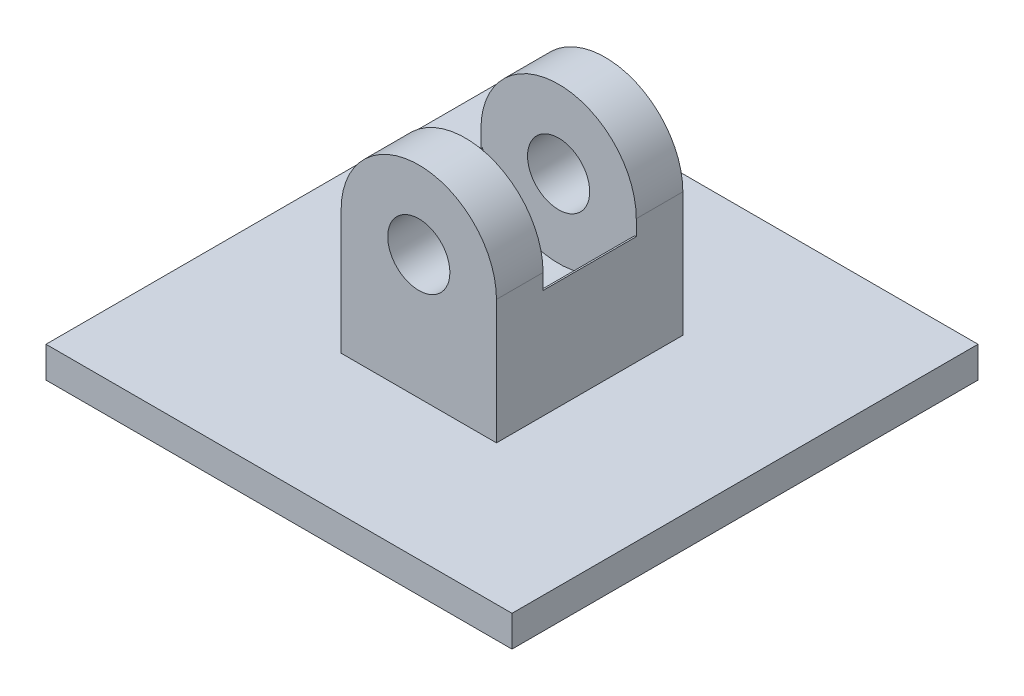
ISO-10303-21;
HEADER;
FILE_DESCRIPTION(('STEP AP214'),'2;1');
FILE_NAME('part.step','',(''),(''),'','','');
FILE_SCHEMA(('AUTOMOTIVE_DESIGN { 1 0 10303 214 1 1 1 1 }'));
ENDSEC;
DATA;
#1=APPLICATION_CONTEXT('core data for automotive mechanical design processes');
#2=APPLICATION_PROTOCOL_DEFINITION('international standard','automotive_design',2000,#1);
#3=PRODUCT_CONTEXT('',#1,'mechanical');
#4=PRODUCT('Part','Part','',(#3));
#5=PRODUCT_RELATED_PRODUCT_CATEGORY('part','',(#4));
#6=PRODUCT_DEFINITION_FORMATION('','',#4);
#7=PRODUCT_DEFINITION_CONTEXT('part definition',#1,'design');
#8=PRODUCT_DEFINITION('design','',#6,#7);
#9=PRODUCT_DEFINITION_SHAPE('','',#8);
#10=(LENGTH_UNIT() NAMED_UNIT(*) SI_UNIT(.MILLI.,.METRE.));
#11=(NAMED_UNIT(*) PLANE_ANGLE_UNIT() SI_UNIT($,.RADIAN.));
#12=(NAMED_UNIT(*) SI_UNIT($,.STERADIAN.) SOLID_ANGLE_UNIT());
#13=UNCERTAINTY_MEASURE_WITH_UNIT(LENGTH_MEASURE(1.E-05),#10,'distance_accuracy_value','');
#14=(GEOMETRIC_REPRESENTATION_CONTEXT(3) GLOBAL_UNCERTAINTY_ASSIGNED_CONTEXT((#13)) GLOBAL_UNIT_ASSIGNED_CONTEXT((#10,
#11,#12)) REPRESENTATION_CONTEXT('',''));
#15=CARTESIAN_POINT('',(0.,0.,0.));
#16=DIRECTION('',(0.,0.,1.));
#17=DIRECTION('',(1.,0.,0.));
#18=AXIS2_PLACEMENT_3D('',#15,#16,#17);
#19=CARTESIAN_POINT('',(0.,50.,-58.2842712474619));
#20=DIRECTION('',(0.,0.,1.));
#21=DIRECTION('',(1.,0.,0.));
#22=AXIS2_PLACEMENT_3D('',#19,#20,#21);
#23=CYLINDRICAL_SURFACE('',#22,10.);
#24=CARTESIAN_POINT('',(0.,50.,-30.));
#25=DIRECTION('',(0.,0.,1.));
#26=DIRECTION('',(1.,0.,0.));
#27=AXIS2_PLACEMENT_3D('',#24,#25,#26);
#28=CIRCLE('',#27,10.);
#29=CARTESIAN_POINT('',(10.,50.,-30.));
#30=VERTEX_POINT('',#29);
#31=EDGE_CURVE('E186',#30,#30,#28,.F.);
#32=ORIENTED_EDGE('',*,*,#31,.T.);
#33=EDGE_LOOP('',(#32));
#34=FACE_BOUND('',#33,.T.);
#35=CARTESIAN_POINT('',(0.,50.,-15.));
#36=DIRECTION('',(0.,0.,-1.));
#37=DIRECTION('',(-1.,0.,0.));
#38=AXIS2_PLACEMENT_3D('',#35,#36,#37);
#39=CIRCLE('',#38,10.);
#40=CARTESIAN_POINT('',(-10.,50.,-15.));
#41=VERTEX_POINT('',#40);
#42=EDGE_CURVE('E56',#41,#41,#39,.F.);
#43=ORIENTED_EDGE('',*,*,#42,.T.);
#44=EDGE_LOOP('',(#43));
#45=FACE_BOUND('',#44,.T.);
#46=ADVANCED_FACE('F48',(#34,#45),#23,.F.);
#47=CARTESIAN_POINT('',(67.4264068711929,45.,15.));
#48=DIRECTION('',(0.,-1.,0.));
#49=DIRECTION('',(0.,0.,-1.));
#50=AXIS2_PLACEMENT_3D('',#47,#48,#49);
#51=PLANE('',#50);
#52=DIRECTION('',(0.,0.,-1.));
#53=VECTOR('',#52,1.);
#54=CARTESIAN_POINT('',(24.4948974278318,45.,85.7106781186548));
#55=LINE('',#54,#53);
#56=CARTESIAN_POINT('',(24.4948974278318,45.,15.));
#57=VERTEX_POINT('',#56);
#58=CARTESIAN_POINT('',(24.4948974278318,45.,-15.));
#59=VERTEX_POINT('',#58);
#60=EDGE_CURVE('E148',#57,#59,#55,.T.);
#61=ORIENTED_EDGE('',*,*,#60,.F.);
#62=DIRECTION('',(-1.,0.,0.));
#63=VECTOR('',#62,1.);
#64=CARTESIAN_POINT('',(67.4264068711929,45.,15.));
#65=LINE('',#64,#63);
#66=CARTESIAN_POINT('',(25.,45.,15.));
#67=VERTEX_POINT('',#66);
#68=EDGE_CURVE('E158',#67,#57,#65,.T.);
#69=ORIENTED_EDGE('',*,*,#68,.F.);
#70=DIRECTION('',(0.,0.,-1.));
#71=VECTOR('',#70,1.);
#72=CARTESIAN_POINT('',(25.,45.,15.));
#73=LINE('',#72,#71);
#74=CARTESIAN_POINT('',(25.,45.,-15.));
#75=VERTEX_POINT('',#74);
#76=EDGE_CURVE('E177',#67,#75,#73,.T.);
#77=ORIENTED_EDGE('',*,*,#76,.T.);
#78=DIRECTION('',(-1.,0.,0.));
#79=VECTOR('',#78,1.);
#80=CARTESIAN_POINT('',(67.4264068711929,45.,-15.));
#81=LINE('',#80,#79);
#82=EDGE_CURVE('E161',#75,#59,#81,.T.);
#83=ORIENTED_EDGE('',*,*,#82,.T.);
#84=EDGE_LOOP('',(#61,#69,#77,#83));
#85=FACE_BOUND('',#84,.T.);
#86=ADVANCED_FACE('F157',(#85),#51,.F.);
#87=DIRECTION('',(0.,0.,-1.));
#88=VECTOR('',#87,1.);
#89=CARTESIAN_POINT('',(-24.4948974278318,45.,85.7106781186548));
#90=LINE('',#89,#88);
#91=CARTESIAN_POINT('',(-24.4948974278318,45.,-15.));
#92=VERTEX_POINT('',#91);
#93=CARTESIAN_POINT('',(-24.4948974278318,45.,15.));
#94=VERTEX_POINT('',#93);
#95=EDGE_CURVE('E13',#92,#94,#90,.F.);
#96=ORIENTED_EDGE('',*,*,#95,.F.);
#97=CARTESIAN_POINT('',(-25.,45.,-15.));
#98=VERTEX_POINT('',#97);
#99=EDGE_CURVE('E176',#92,#98,#81,.T.);
#100=ORIENTED_EDGE('',*,*,#99,.T.);
#101=DIRECTION('',(0.,0.,1.));
#102=VECTOR('',#101,1.);
#103=CARTESIAN_POINT('',(-25.,45.,15.));
#104=LINE('',#103,#102);
#105=CARTESIAN_POINT('',(-25.,45.,15.));
#106=VERTEX_POINT('',#105);
#107=EDGE_CURVE('E278',#98,#106,#104,.T.);
#108=ORIENTED_EDGE('',*,*,#107,.T.);
#109=EDGE_CURVE('E167',#94,#106,#65,.T.);
#110=ORIENTED_EDGE('',*,*,#109,.F.);
#111=EDGE_LOOP('',(#96,#100,#108,#110));
#112=FACE_BOUND('',#111,.T.);
#113=ADVANCED_FACE('F299',(#112),#51,.F.);
#114=CARTESIAN_POINT('',(0.,50.,-85.9016994374947));
#115=DIRECTION('',(0.,0.,1.));
#116=DIRECTION('',(1.,0.,0.));
#117=AXIS2_PLACEMENT_3D('',#114,#115,#116);
#118=CYLINDRICAL_SURFACE('',#117,25.);
#119=CARTESIAN_POINT('',(0.,50.,-15.));
#120=DIRECTION('',(0.,0.,-1.));
#121=DIRECTION('',(-1.,0.,0.));
#122=AXIS2_PLACEMENT_3D('',#119,#120,#121);
#123=CIRCLE('',#122,25.);
#124=CARTESIAN_POINT('',(25.,50.,-15.));
#125=VERTEX_POINT('',#124);
#126=CARTESIAN_POINT('',(-25.,50.,-15.));
#127=VERTEX_POINT('',#126);
#128=EDGE_CURVE('E181',#125,#127,#123,.F.);
#129=ORIENTED_EDGE('',*,*,#128,.F.);
#130=DIRECTION('',(0.,0.,-1.));
#131=VECTOR('',#130,1.);
#132=CARTESIAN_POINT('',(25.,50.,30.));
#133=LINE('',#132,#131);
#134=CARTESIAN_POINT('',(25.,50.,-30.));
#135=VERTEX_POINT('',#134);
#136=EDGE_CURVE('E198',#125,#135,#133,.T.);
#137=ORIENTED_EDGE('',*,*,#136,.T.);
#138=CARTESIAN_POINT('',(0.,50.,-30.));
#139=DIRECTION('',(0.,0.,1.));
#140=DIRECTION('',(1.,0.,0.));
#141=AXIS2_PLACEMENT_3D('',#138,#139,#140);
#142=CIRCLE('',#141,25.);
#143=CARTESIAN_POINT('',(-25.,50.,-30.));
#144=VERTEX_POINT('',#143);
#145=EDGE_CURVE('E190',#144,#135,#142,.F.);
#146=ORIENTED_EDGE('',*,*,#145,.F.);
#147=DIRECTION('',(0.,0.,1.));
#148=VECTOR('',#147,1.);
#149=CARTESIAN_POINT('',(-25.,50.,30.));
#150=LINE('',#149,#148);
#151=EDGE_CURVE('E195',#144,#127,#150,.T.);
#152=ORIENTED_EDGE('',*,*,#151,.T.);
#153=EDGE_LOOP('',(#129,#137,#146,#152));
#154=FACE_BOUND('',#153,.T.);
#155=ADVANCED_FACE('F281',(#154),#118,.T.);
#156=CARTESIAN_POINT('',(-75.,9.99999999999999,75.));
#157=DIRECTION('',(1.,0.,0.));
#158=DIRECTION('',(0.,0.,-1.));
#159=AXIS2_PLACEMENT_3D('',#156,#157,#158);
#160=PLANE('',#159);
#161=DIRECTION('',(0.,0.,1.));
#162=VECTOR('',#161,1.);
#163=CARTESIAN_POINT('',(-75.,0.,75.));
#164=LINE('',#163,#162);
#165=CARTESIAN_POINT('',(-75.,0.,-75.));
#166=VERTEX_POINT('',#165);
#167=CARTESIAN_POINT('',(-75.,0.,75.));
#168=VERTEX_POINT('',#167);
#169=EDGE_CURVE('E224',#166,#168,#164,.T.);
#170=ORIENTED_EDGE('',*,*,#169,.T.);
#171=DIRECTION('',(0.,-1.,0.));
#172=VECTOR('',#171,1.);
#173=CARTESIAN_POINT('',(-75.,9.99999999999999,75.));
#174=LINE('',#173,#172);
#175=CARTESIAN_POINT('',(-75.,9.99999999999999,75.));
#176=VERTEX_POINT('',#175);
#177=EDGE_CURVE('E251',#176,#168,#174,.T.);
#178=ORIENTED_EDGE('',*,*,#177,.F.);
#179=DIRECTION('',(0.,0.,1.));
#180=VECTOR('',#179,1.);
#181=CARTESIAN_POINT('',(-75.,9.99999999999999,75.));
#182=LINE('',#181,#180);
#183=CARTESIAN_POINT('',(-75.,9.99999999999999,-75.));
#184=VERTEX_POINT('',#183);
#185=EDGE_CURVE('E225',#184,#176,#182,.T.);
#186=ORIENTED_EDGE('',*,*,#185,.F.);
#187=DIRECTION('',(0.,-1.,0.));
#188=VECTOR('',#187,1.);
#189=CARTESIAN_POINT('',(-75.,9.99999999999999,-75.));
#190=LINE('',#189,#188);
#191=EDGE_CURVE('E235',#184,#166,#190,.T.);
#192=ORIENTED_EDGE('',*,*,#191,.T.);
#193=EDGE_LOOP('',(#170,#178,#186,#192));
#194=FACE_BOUND('',#193,.T.);
#195=ADVANCED_FACE('F50',(#194),#160,.F.);
#196=CARTESIAN_POINT('',(75.,9.99999999999999,74.9999999999999));
#197=DIRECTION('',(0.,0.,-1.));
#198=DIRECTION('',(-1.,0.,0.));
#199=AXIS2_PLACEMENT_3D('',#196,#197,#198);
#200=PLANE('',#199);
#201=DIRECTION('',(1.,0.,0.));
#202=VECTOR('',#201,1.);
#203=CARTESIAN_POINT('',(75.,0.,74.9999999999999));
#204=LINE('',#203,#202);
#205=CARTESIAN_POINT('',(75.,0.,74.9999999999999));
#206=VERTEX_POINT('',#205);
#207=EDGE_CURVE('E238',#168,#206,#204,.T.);
#208=ORIENTED_EDGE('',*,*,#207,.T.);
#209=DIRECTION('',(0.,-1.,0.));
#210=VECTOR('',#209,1.);
#211=CARTESIAN_POINT('',(75.,9.99999999999999,74.9999999999999));
#212=LINE('',#211,#210);
#213=CARTESIAN_POINT('',(75.,9.99999999999999,74.9999999999999));
#214=VERTEX_POINT('',#213);
#215=EDGE_CURVE('E248',#214,#206,#212,.T.);
#216=ORIENTED_EDGE('',*,*,#215,.F.);
#217=DIRECTION('',(1.,0.,0.));
#218=VECTOR('',#217,1.);
#219=CARTESIAN_POINT('',(75.,9.99999999999999,74.9999999999999));
#220=LINE('',#219,#218);
#221=EDGE_CURVE('E228',#176,#214,#220,.T.);
#222=ORIENTED_EDGE('',*,*,#221,.F.);
#223=ORIENTED_EDGE('',*,*,#177,.T.);
#224=EDGE_LOOP('',(#208,#216,#222,#223));
#225=FACE_BOUND('',#224,.T.);
#226=ADVANCED_FACE('F345',(#225),#200,.F.);
#227=CARTESIAN_POINT('',(75.,9.99999999999999,74.9999999999999));
#228=DIRECTION('',(-1.,0.,0.));
#229=DIRECTION('',(0.,0.,1.));
#230=AXIS2_PLACEMENT_3D('',#227,#228,#229);
#231=PLANE('',#230);
#232=DIRECTION('',(0.,0.,-1.));
#233=VECTOR('',#232,1.);
#234=CARTESIAN_POINT('',(75.,0.,74.9999999999999));
#235=LINE('',#234,#233);
#236=CARTESIAN_POINT('',(75.,0.,-75.0000000000001));
#237=VERTEX_POINT('',#236);
#238=EDGE_CURVE('E240',#206,#237,#235,.T.);
#239=ORIENTED_EDGE('',*,*,#238,.T.);
#240=DIRECTION('',(0.,-1.,0.));
#241=VECTOR('',#240,1.);
#242=CARTESIAN_POINT('',(75.,9.99999999999999,-75.0000000000001));
#243=LINE('',#242,#241);
#244=CARTESIAN_POINT('',(75.,9.99999999999999,-75.0000000000001));
#245=VERTEX_POINT('',#244);
#246=EDGE_CURVE('E245',#245,#237,#243,.T.);
#247=ORIENTED_EDGE('',*,*,#246,.F.);
#248=DIRECTION('',(0.,0.,-1.));
#249=VECTOR('',#248,1.);
#250=CARTESIAN_POINT('',(75.,9.99999999999999,74.9999999999999));
#251=LINE('',#250,#249);
#252=EDGE_CURVE('E231',#214,#245,#251,.T.);
#253=ORIENTED_EDGE('',*,*,#252,.F.);
#254=ORIENTED_EDGE('',*,*,#215,.T.);
#255=EDGE_LOOP('',(#239,#247,#253,#254));
#256=FACE_BOUND('',#255,.T.);
#257=ADVANCED_FACE('F342',(#256),#231,.F.);
#258=CARTESIAN_POINT('',(75.,9.99999999999999,-75.0000000000001));
#259=DIRECTION('',(0.,0.,1.));
#260=DIRECTION('',(1.,0.,0.));
#261=AXIS2_PLACEMENT_3D('',#258,#259,#260);
#262=PLANE('',#261);
#263=DIRECTION('',(-1.,0.,0.));
#264=VECTOR('',#263,1.);
#265=CARTESIAN_POINT('',(75.,0.,-75.0000000000001));
#266=LINE('',#265,#264);
#267=EDGE_CURVE('E229',#237,#166,#266,.T.);
#268=ORIENTED_EDGE('',*,*,#267,.T.);
#269=ORIENTED_EDGE('',*,*,#191,.F.);
#270=DIRECTION('',(-1.,0.,0.));
#271=VECTOR('',#270,1.);
#272=CARTESIAN_POINT('',(75.,9.99999999999999,-75.0000000000001));
#273=LINE('',#272,#271);
#274=EDGE_CURVE('E233',#245,#184,#273,.T.);
#275=ORIENTED_EDGE('',*,*,#274,.F.);
#276=ORIENTED_EDGE('',*,*,#246,.T.);
#277=EDGE_LOOP('',(#268,#269,#275,#276));
#278=FACE_BOUND('',#277,.T.);
#279=ADVANCED_FACE('F336',(#278),#262,.F.);
#280=CARTESIAN_POINT('',(0.,9.99999999999999,0.));
#281=DIRECTION('',(0.,1.,0.));
#282=DIRECTION('',(0.,0.,1.));
#283=AXIS2_PLACEMENT_3D('',#280,#281,#282);
#284=PLANE('',#283);
#285=DIRECTION('',(0.,0.,1.));
#286=VECTOR('',#285,1.);
#287=CARTESIAN_POINT('',(-25.,9.99999999999999,30.));
#288=LINE('',#287,#286);
#289=CARTESIAN_POINT('',(-25.,9.99999999999999,-30.));
#290=VERTEX_POINT('',#289);
#291=CARTESIAN_POINT('',(-25.,9.99999999999999,30.));
#292=VERTEX_POINT('',#291);
#293=EDGE_CURVE('E70',#290,#292,#288,.T.);
#294=ORIENTED_EDGE('',*,*,#293,.F.);
#295=DIRECTION('',(-1.,0.,0.));
#296=VECTOR('',#295,1.);
#297=CARTESIAN_POINT('',(25.,9.99999999999999,-30.));
#298=LINE('',#297,#296);
#299=CARTESIAN_POINT('',(25.,9.99999999999999,-30.));
#300=VERTEX_POINT('',#299);
#301=EDGE_CURVE('E211',#300,#290,#298,.T.);
#302=ORIENTED_EDGE('',*,*,#301,.F.);
#303=DIRECTION('',(0.,0.,-1.));
#304=VECTOR('',#303,1.);
#305=CARTESIAN_POINT('',(25.,9.99999999999999,30.));
#306=LINE('',#305,#304);
#307=CARTESIAN_POINT('',(25.,9.99999999999999,30.));
#308=VERTEX_POINT('',#307);
#309=EDGE_CURVE('E208',#308,#300,#306,.T.);
#310=ORIENTED_EDGE('',*,*,#309,.F.);
#311=DIRECTION('',(1.,0.,0.));
#312=VECTOR('',#311,1.);
#313=CARTESIAN_POINT('',(25.,9.99999999999999,30.));
#314=LINE('',#313,#312);
#315=EDGE_CURVE('E205',#292,#308,#314,.T.);
#316=ORIENTED_EDGE('',*,*,#315,.F.);
#317=EDGE_LOOP('',(#294,#302,#310,#316));
#318=FACE_BOUND('',#317,.T.);
#319=ORIENTED_EDGE('',*,*,#185,.T.);
#320=ORIENTED_EDGE('',*,*,#221,.T.);
#321=ORIENTED_EDGE('',*,*,#252,.T.);
#322=ORIENTED_EDGE('',*,*,#274,.T.);
#323=EDGE_LOOP('',(#319,#320,#321,#322));
#324=FACE_BOUND('',#323,.T.);
#325=ADVANCED_FACE('F333',(#318,#324),#284,.T.);
#326=CARTESIAN_POINT('',(0.,0.,0.));
#327=DIRECTION('',(0.,1.,0.));
#328=DIRECTION('',(0.,0.,1.));
#329=AXIS2_PLACEMENT_3D('',#326,#327,#328);
#330=PLANE('',#329);
#331=ORIENTED_EDGE('',*,*,#169,.F.);
#332=ORIENTED_EDGE('',*,*,#267,.F.);
#333=ORIENTED_EDGE('',*,*,#238,.F.);
#334=ORIENTED_EDGE('',*,*,#207,.F.);
#335=EDGE_LOOP('',(#331,#332,#333,#334));
#336=FACE_BOUND('',#335,.T.);
#337=ADVANCED_FACE('F329',(#336),#330,.F.);
#338=CARTESIAN_POINT('',(-25.,50.,30.));
#339=DIRECTION('',(1.,0.,0.));
#340=DIRECTION('',(0.,0.,-1.));
#341=AXIS2_PLACEMENT_3D('',#338,#339,#340);
#342=PLANE('',#341);
#343=ORIENTED_EDGE('',*,*,#107,.F.);
#344=DIRECTION('',(0.,-1.,0.));
#345=VECTOR('',#344,1.);
#346=CARTESIAN_POINT('',(-25.,45.,-15.));
#347=LINE('',#346,#345);
#348=EDGE_CURVE('E162',#127,#98,#347,.T.);
#349=ORIENTED_EDGE('',*,*,#348,.F.);
#350=ORIENTED_EDGE('',*,*,#151,.F.);
#351=DIRECTION('',(0.,-1.,0.));
#352=VECTOR('',#351,1.);
#353=CARTESIAN_POINT('',(-25.,50.,-30.));
#354=LINE('',#353,#352);
#355=EDGE_CURVE('E203',#144,#290,#354,.T.);
#356=ORIENTED_EDGE('',*,*,#355,.T.);
#357=ORIENTED_EDGE('',*,*,#293,.T.);
#358=DIRECTION('',(0.,-1.,0.));
#359=VECTOR('',#358,1.);
#360=CARTESIAN_POINT('',(-25.,50.,30.));
#361=LINE('',#360,#359);
#362=CARTESIAN_POINT('',(-25.,50.,30.));
#363=VERTEX_POINT('',#362);
#364=EDGE_CURVE('E221',#363,#292,#361,.T.);
#365=ORIENTED_EDGE('',*,*,#364,.F.);
#366=CARTESIAN_POINT('',(-25.,50.,15.));
#367=VERTEX_POINT('',#366);
#368=EDGE_CURVE('E199',#367,#363,#150,.T.);
#369=ORIENTED_EDGE('',*,*,#368,.F.);
#370=DIRECTION('',(0.,1.,0.));
#371=VECTOR('',#370,1.);
#372=CARTESIAN_POINT('',(-25.,45.,15.));
#373=LINE('',#372,#371);
#374=EDGE_CURVE('E173',#106,#367,#373,.T.);
#375=ORIENTED_EDGE('',*,*,#374,.F.);
#376=EDGE_LOOP('',(#343,#349,#350,#356,#357,#365,#369,#375));
#377=FACE_BOUND('',#376,.T.);
#378=ADVANCED_FACE('F274',(#377),#342,.F.);
#379=CARTESIAN_POINT('',(25.,50.,30.));
#380=DIRECTION('',(0.,0.,-1.));
#381=DIRECTION('',(-1.,0.,0.));
#382=AXIS2_PLACEMENT_3D('',#379,#380,#381);
#383=PLANE('',#382);
#384=CARTESIAN_POINT('',(0.,50.,30.));
#385=DIRECTION('',(0.,0.,1.));
#386=DIRECTION('',(1.,0.,0.));
#387=AXIS2_PLACEMENT_3D('',#384,#385,#386);
#388=CIRCLE('',#387,10.);
#389=CARTESIAN_POINT('',(10.,50.,30.));
#390=VERTEX_POINT('',#389);
#391=EDGE_CURVE('E183',#390,#390,#388,.T.);
#392=ORIENTED_EDGE('',*,*,#391,.F.);
#393=EDGE_LOOP('',(#392));
#394=FACE_BOUND('',#393,.T.);
#395=ORIENTED_EDGE('',*,*,#315,.T.);
#396=DIRECTION('',(0.,-1.,0.));
#397=VECTOR('',#396,1.);
#398=CARTESIAN_POINT('',(25.,50.,30.));
#399=LINE('',#398,#397);
#400=CARTESIAN_POINT('',(25.,50.,30.));
#401=VERTEX_POINT('',#400);
#402=EDGE_CURVE('E218',#401,#308,#399,.T.);
#403=ORIENTED_EDGE('',*,*,#402,.F.);
#404=CARTESIAN_POINT('',(0.,50.,30.));
#405=DIRECTION('',(0.,0.,1.));
#406=DIRECTION('',(1.,0.,0.));
#407=AXIS2_PLACEMENT_3D('',#404,#405,#406);
#408=CIRCLE('',#407,25.);
#409=EDGE_CURVE('E189',#401,#363,#408,.T.);
#410=ORIENTED_EDGE('',*,*,#409,.T.);
#411=ORIENTED_EDGE('',*,*,#364,.T.);
#412=EDGE_LOOP('',(#395,#403,#410,#411));
#413=FACE_BOUND('',#412,.T.);
#414=ADVANCED_FACE('F289',(#394,#413),#383,.F.);
#415=CARTESIAN_POINT('',(25.,50.,30.));
#416=DIRECTION('',(-1.,0.,0.));
#417=DIRECTION('',(0.,0.,1.));
#418=AXIS2_PLACEMENT_3D('',#415,#416,#417);
#419=PLANE('',#418);
#420=ORIENTED_EDGE('',*,*,#136,.F.);
#421=DIRECTION('',(0.,1.,0.));
#422=VECTOR('',#421,1.);
#423=CARTESIAN_POINT('',(25.,45.,-15.));
#424=LINE('',#423,#422);
#425=EDGE_CURVE('E169',#75,#125,#424,.T.);
#426=ORIENTED_EDGE('',*,*,#425,.F.);
#427=ORIENTED_EDGE('',*,*,#76,.F.);
#428=DIRECTION('',(0.,-1.,0.));
#429=VECTOR('',#428,1.);
#430=CARTESIAN_POINT('',(25.,45.,15.));
#431=LINE('',#430,#429);
#432=CARTESIAN_POINT('',(25.,50.,15.));
#433=VERTEX_POINT('',#432);
#434=EDGE_CURVE('E166',#433,#67,#431,.T.);
#435=ORIENTED_EDGE('',*,*,#434,.F.);
#436=EDGE_CURVE('E200',#401,#433,#133,.T.);
#437=ORIENTED_EDGE('',*,*,#436,.F.);
#438=ORIENTED_EDGE('',*,*,#402,.T.);
#439=ORIENTED_EDGE('',*,*,#309,.T.);
#440=DIRECTION('',(0.,-1.,0.));
#441=VECTOR('',#440,1.);
#442=CARTESIAN_POINT('',(25.,50.,-30.));
#443=LINE('',#442,#441);
#444=EDGE_CURVE('E215',#135,#300,#443,.T.);
#445=ORIENTED_EDGE('',*,*,#444,.F.);
#446=EDGE_LOOP('',(#420,#426,#427,#435,#437,#438,#439,#445));
#447=FACE_BOUND('',#446,.T.);
#448=ADVANCED_FACE('F295',(#447),#419,.F.);
#449=CARTESIAN_POINT('',(25.,50.,-30.));
#450=DIRECTION('',(0.,0.,1.));
#451=DIRECTION('',(1.,0.,0.));
#452=AXIS2_PLACEMENT_3D('',#449,#450,#451);
#453=PLANE('',#452);
#454=ORIENTED_EDGE('',*,*,#31,.F.);
#455=EDGE_LOOP('',(#454));
#456=FACE_BOUND('',#455,.T.);
#457=ORIENTED_EDGE('',*,*,#301,.T.);
#458=ORIENTED_EDGE('',*,*,#355,.F.);
#459=ORIENTED_EDGE('',*,*,#145,.T.);
#460=ORIENTED_EDGE('',*,*,#444,.T.);
#461=EDGE_LOOP('',(#457,#458,#459,#460));
#462=FACE_BOUND('',#461,.T.);
#463=ADVANCED_FACE('F284',(#456,#462),#453,.F.);
#464=CARTESIAN_POINT('',(0.,50.,15.));
#465=DIRECTION('',(0.,0.,1.));
#466=DIRECTION('',(1.,0.,0.));
#467=AXIS2_PLACEMENT_3D('',#464,#465,#466);
#468=CIRCLE('',#467,25.);
#469=EDGE_CURVE('E179',#367,#433,#468,.F.);
#470=ORIENTED_EDGE('',*,*,#469,.F.);
#471=ORIENTED_EDGE('',*,*,#368,.T.);
#472=ORIENTED_EDGE('',*,*,#409,.F.);
#473=ORIENTED_EDGE('',*,*,#436,.T.);
#474=EDGE_LOOP('',(#470,#471,#472,#473));
#475=FACE_BOUND('',#474,.T.);
#476=ADVANCED_FACE('F293',(#475),#118,.T.);
#477=CARTESIAN_POINT('',(0.,50.,15.));
#478=DIRECTION('',(0.,0.,1.));
#479=DIRECTION('',(1.,0.,0.));
#480=AXIS2_PLACEMENT_3D('',#477,#478,#479);
#481=CIRCLE('',#480,10.);
#482=CARTESIAN_POINT('',(10.,50.,15.));
#483=VERTEX_POINT('',#482);
#484=EDGE_CURVE('E254',#483,#483,#481,.F.);
#485=ORIENTED_EDGE('',*,*,#484,.T.);
#486=EDGE_LOOP('',(#485));
#487=FACE_BOUND('',#486,.T.);
#488=ORIENTED_EDGE('',*,*,#391,.T.);
#489=EDGE_LOOP('',(#488));
#490=FACE_BOUND('',#489,.T.);
#491=ADVANCED_FACE('F263',(#487,#490),#23,.F.);
#492=CARTESIAN_POINT('',(67.4264068711929,45.,-15.));
#493=DIRECTION('',(0.,0.,-1.));
#494=DIRECTION('',(-1.,0.,0.));
#495=AXIS2_PLACEMENT_3D('',#492,#493,#494);
#496=PLANE('',#495);
#497=ORIENTED_EDGE('',*,*,#42,.F.);
#498=EDGE_LOOP('',(#497));
#499=FACE_BOUND('',#498,.T.);
#500=ORIENTED_EDGE('',*,*,#128,.T.);
#501=ORIENTED_EDGE('',*,*,#348,.T.);
#502=ORIENTED_EDGE('',*,*,#99,.F.);
#503=CARTESIAN_POINT('',(0.,50.,-15.));
#504=DIRECTION('',(0.,0.,1.));
#505=DIRECTION('',(1.,0.,0.));
#506=AXIS2_PLACEMENT_3D('',#503,#504,#505);
#507=CIRCLE('',#506,25.);
#508=EDGE_CURVE('E152',#92,#59,#507,.T.);
#509=ORIENTED_EDGE('',*,*,#508,.T.);
#510=ORIENTED_EDGE('',*,*,#82,.F.);
#511=ORIENTED_EDGE('',*,*,#425,.T.);
#512=EDGE_LOOP('',(#500,#501,#502,#509,#510,#511));
#513=FACE_BOUND('',#512,.T.);
#514=ADVANCED_FACE('F260',(#499,#513),#496,.F.);
#515=CARTESIAN_POINT('',(67.4264068711929,45.,15.));
#516=DIRECTION('',(0.,0.,1.));
#517=DIRECTION('',(1.,0.,0.));
#518=AXIS2_PLACEMENT_3D('',#515,#516,#517);
#519=PLANE('',#518);
#520=ORIENTED_EDGE('',*,*,#484,.F.);
#521=EDGE_LOOP('',(#520));
#522=FACE_BOUND('',#521,.T.);
#523=ORIENTED_EDGE('',*,*,#469,.T.);
#524=ORIENTED_EDGE('',*,*,#434,.T.);
#525=ORIENTED_EDGE('',*,*,#68,.T.);
#526=CARTESIAN_POINT('',(0.,50.,15.));
#527=DIRECTION('',(0.,0.,1.));
#528=DIRECTION('',(1.,0.,0.));
#529=AXIS2_PLACEMENT_3D('',#526,#527,#528);
#530=CIRCLE('',#529,25.);
#531=EDGE_CURVE('E63',#94,#57,#530,.T.);
#532=ORIENTED_EDGE('',*,*,#531,.F.);
#533=ORIENTED_EDGE('',*,*,#109,.T.);
#534=ORIENTED_EDGE('',*,*,#374,.T.);
#535=EDGE_LOOP('',(#523,#524,#525,#532,#533,#534));
#536=FACE_BOUND('',#535,.T.);
#537=ADVANCED_FACE('F164',(#522,#536),#519,.F.);
#538=CARTESIAN_POINT('',(0.,50.,85.7106781186548));
#539=DIRECTION('',(0.,0.,-1.));
#540=DIRECTION('',(-1.,0.,0.));
#541=AXIS2_PLACEMENT_3D('',#538,#539,#540);
#542=CYLINDRICAL_SURFACE('',#541,25.);
#543=ORIENTED_EDGE('',*,*,#60,.T.);
#544=ORIENTED_EDGE('',*,*,#508,.F.);
#545=ORIENTED_EDGE('',*,*,#95,.T.);
#546=ORIENTED_EDGE('',*,*,#531,.T.);
#547=EDGE_LOOP('',(#543,#544,#545,#546));
#548=FACE_BOUND('',#547,.T.);
#549=ADVANCED_FACE('F147',(#548),#542,.F.);
#550=CLOSED_SHELL('',(#46,#86,#113,#155,#195,#226,#257,#279,#325,#337,#378,#414,#448,#463,#476,
#491,#514,#537,#549));
#551=MANIFOLD_SOLID_BREP('B2',#550);
#552=ADVANCED_BREP_SHAPE_REPRESENTATION('',(#18,#551),#14);
#553=SHAPE_DEFINITION_REPRESENTATION(#9,#552);
ENDSEC;
END-ISO-10303-21;
